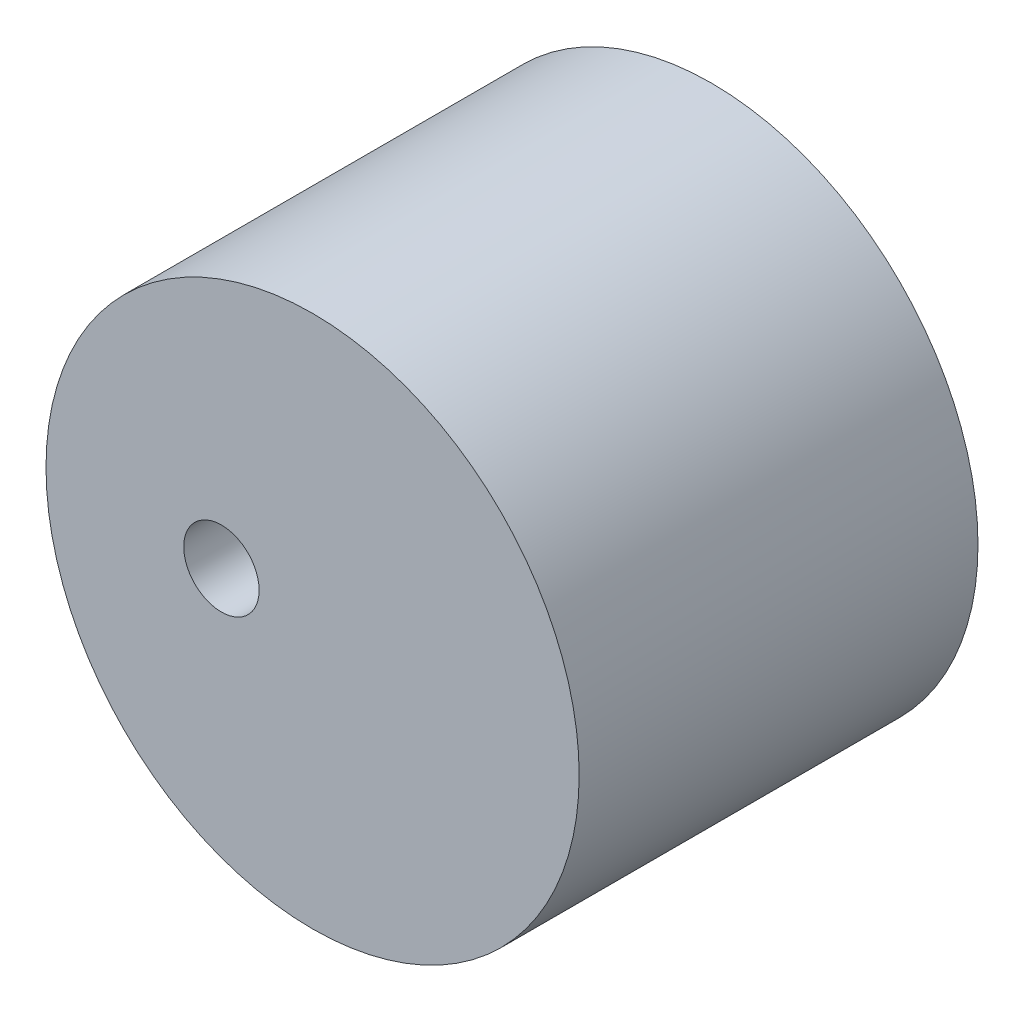
ISO-10303-21;
HEADER;
FILE_DESCRIPTION(('STEP AP214'),'2;1');
FILE_NAME('part.step','',(''),(''),'','','');
FILE_SCHEMA(('AUTOMOTIVE_DESIGN { 1 0 10303 214 1 1 1 1 }'));
ENDSEC;
DATA;
#1=APPLICATION_CONTEXT('core data for automotive mechanical design processes');
#2=APPLICATION_PROTOCOL_DEFINITION('international standard','automotive_design',2000,#1);
#3=PRODUCT_CONTEXT('',#1,'mechanical');
#4=PRODUCT('Part','Part','',(#3));
#5=PRODUCT_RELATED_PRODUCT_CATEGORY('part','',(#4));
#6=PRODUCT_DEFINITION_FORMATION('','',#4);
#7=PRODUCT_DEFINITION_CONTEXT('part definition',#1,'design');
#8=PRODUCT_DEFINITION('design','',#6,#7);
#9=PRODUCT_DEFINITION_SHAPE('','',#8);
#10=(LENGTH_UNIT() NAMED_UNIT(*) SI_UNIT(.MILLI.,.METRE.));
#11=(NAMED_UNIT(*) PLANE_ANGLE_UNIT() SI_UNIT($,.RADIAN.));
#12=(NAMED_UNIT(*) SI_UNIT($,.STERADIAN.) SOLID_ANGLE_UNIT());
#13=UNCERTAINTY_MEASURE_WITH_UNIT(LENGTH_MEASURE(1.E-05),#10,'distance_accuracy_value','');
#14=(GEOMETRIC_REPRESENTATION_CONTEXT(3) GLOBAL_UNCERTAINTY_ASSIGNED_CONTEXT((#13)) GLOBAL_UNIT_ASSIGNED_CONTEXT((#10,
#11,#12)) REPRESENTATION_CONTEXT('',''));
#15=CARTESIAN_POINT('',(0.,0.,0.));
#16=DIRECTION('',(0.,0.,1.));
#17=DIRECTION('',(1.,0.,0.));
#18=AXIS2_PLACEMENT_3D('',#15,#16,#17);
#19=CARTESIAN_POINT('',(0.,0.,35.));
#20=DIRECTION('',(0.,0.,1.));
#21=DIRECTION('',(1.,0.,0.));
#22=AXIS2_PLACEMENT_3D('',#19,#20,#21);
#23=PLANE('',#22);
#24=CARTESIAN_POINT('',(0.,0.,35.));
#25=DIRECTION('',(0.,0.,1.));
#26=DIRECTION('',(1.,0.,0.));
#27=AXIS2_PLACEMENT_3D('',#24,#25,#26);
#28=CIRCLE('',#27,23.39375);
#29=CARTESIAN_POINT('',(23.39375,0.,35.));
#30=VERTEX_POINT('',#29);
#31=EDGE_CURVE('E10',#30,#30,#28,.T.);
#32=ORIENTED_EDGE('',*,*,#31,.T.);
#33=EDGE_LOOP('',(#32));
#34=FACE_BOUND('',#33,.T.);
#35=CARTESIAN_POINT('',(-8.,0.,35.));
#36=DIRECTION('',(0.,0.,1.));
#37=DIRECTION('',(1.,0.,0.));
#38=AXIS2_PLACEMENT_3D('',#35,#36,#37);
#39=CIRCLE('',#38,3.3085);
#40=CARTESIAN_POINT('',(-4.6915,0.,35.));
#41=VERTEX_POINT('',#40);
#42=EDGE_CURVE('E50',#41,#41,#39,.T.);
#43=ORIENTED_EDGE('',*,*,#42,.F.);
#44=EDGE_LOOP('',(#43));
#45=FACE_BOUND('',#44,.T.);
#46=ADVANCED_FACE('F37',(#34,#45),#23,.T.);
#47=CARTESIAN_POINT('',(0.,0.,0.));
#48=DIRECTION('',(0.,0.,1.));
#49=DIRECTION('',(1.,0.,0.));
#50=AXIS2_PLACEMENT_3D('',#47,#48,#49);
#51=PLANE('',#50);
#52=CARTESIAN_POINT('',(0.,0.,0.));
#53=DIRECTION('',(0.,0.,1.));
#54=DIRECTION('',(1.,0.,0.));
#55=AXIS2_PLACEMENT_3D('',#52,#53,#54);
#56=CIRCLE('',#55,23.39375);
#57=CARTESIAN_POINT('',(23.39375,0.,0.));
#58=VERTEX_POINT('',#57);
#59=EDGE_CURVE('E41',#58,#58,#56,.T.);
#60=ORIENTED_EDGE('',*,*,#59,.F.);
#61=EDGE_LOOP('',(#60));
#62=FACE_BOUND('',#61,.T.);
#63=CARTESIAN_POINT('',(-8.,0.,0.));
#64=DIRECTION('',(0.,0.,1.));
#65=DIRECTION('',(1.,0.,0.));
#66=AXIS2_PLACEMENT_3D('',#63,#64,#65);
#67=CIRCLE('',#66,3.3085);
#68=CARTESIAN_POINT('',(-4.6915,0.,0.));
#69=VERTEX_POINT('',#68);
#70=EDGE_CURVE('E52',#69,#69,#67,.T.);
#71=ORIENTED_EDGE('',*,*,#70,.T.);
#72=EDGE_LOOP('',(#71));
#73=FACE_BOUND('',#72,.T.);
#74=ADVANCED_FACE('F64',(#62,#73),#51,.F.);
#75=CARTESIAN_POINT('',(0.,0.,35.));
#76=DIRECTION('',(0.,0.,-1.));
#77=DIRECTION('',(-1.,0.,0.));
#78=AXIS2_PLACEMENT_3D('',#75,#76,#77);
#79=CYLINDRICAL_SURFACE('',#78,23.39375);
#80=ORIENTED_EDGE('',*,*,#31,.F.);
#81=EDGE_LOOP('',(#80));
#82=FACE_BOUND('',#81,.T.);
#83=ORIENTED_EDGE('',*,*,#59,.T.);
#84=EDGE_LOOP('',(#83));
#85=FACE_BOUND('',#84,.T.);
#86=ADVANCED_FACE('F39',(#82,#85),#79,.T.);
#87=CARTESIAN_POINT('',(-8.,0.,35.));
#88=DIRECTION('',(0.,0.,-1.));
#89=DIRECTION('',(-1.,0.,0.));
#90=AXIS2_PLACEMENT_3D('',#87,#88,#89);
#91=CYLINDRICAL_SURFACE('',#90,3.3085);
#92=ORIENTED_EDGE('',*,*,#42,.T.);
#93=EDGE_LOOP('',(#92));
#94=FACE_BOUND('',#93,.T.);
#95=ORIENTED_EDGE('',*,*,#70,.F.);
#96=EDGE_LOOP('',(#95));
#97=FACE_BOUND('',#96,.T.);
#98=ADVANCED_FACE('F60',(#94,#97),#91,.F.);
#99=CLOSED_SHELL('',(#46,#74,#86,#98));
#100=MANIFOLD_SOLID_BREP('B2',#99);
#101=ADVANCED_BREP_SHAPE_REPRESENTATION('',(#18,#100),#14);
#102=SHAPE_DEFINITION_REPRESENTATION(#9,#101);
ENDSEC;
END-ISO-10303-21;
